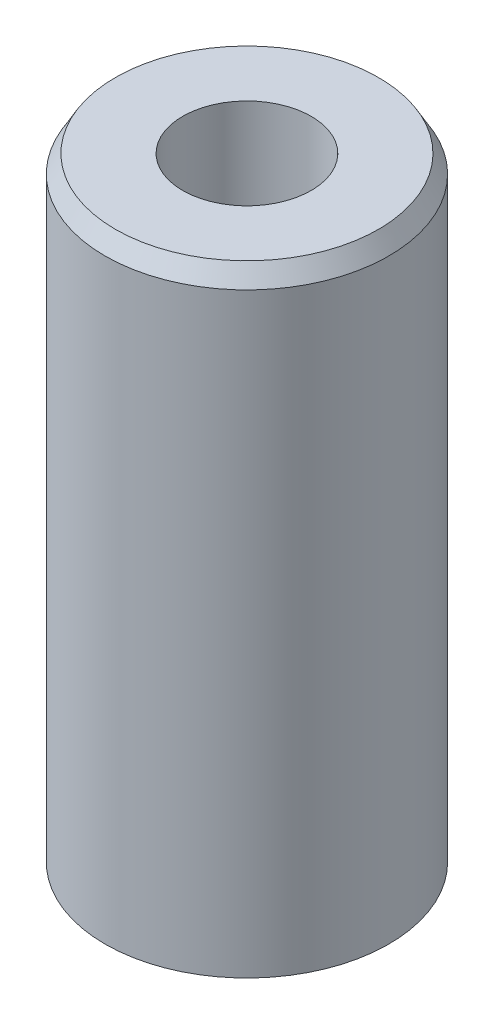
ISO-10303-21;
HEADER;
FILE_DESCRIPTION(('STEP AP214'),'2;1');
FILE_NAME('part.step','',(''),(''),'','','');
FILE_SCHEMA(('AUTOMOTIVE_DESIGN { 1 0 10303 214 1 1 1 1 }'));
ENDSEC;
DATA;
#1=APPLICATION_CONTEXT('core data for automotive mechanical design processes');
#2=APPLICATION_PROTOCOL_DEFINITION('international standard','automotive_design',2000,#1);
#3=PRODUCT_CONTEXT('',#1,'mechanical');
#4=PRODUCT('Part','Part','',(#3));
#5=PRODUCT_RELATED_PRODUCT_CATEGORY('part','',(#4));
#6=PRODUCT_DEFINITION_FORMATION('','',#4);
#7=PRODUCT_DEFINITION_CONTEXT('part definition',#1,'design');
#8=PRODUCT_DEFINITION('design','',#6,#7);
#9=PRODUCT_DEFINITION_SHAPE('','',#8);
#10=(LENGTH_UNIT() NAMED_UNIT(*) SI_UNIT(.MILLI.,.METRE.));
#11=(NAMED_UNIT(*) PLANE_ANGLE_UNIT() SI_UNIT($,.RADIAN.));
#12=(NAMED_UNIT(*) SI_UNIT($,.STERADIAN.) SOLID_ANGLE_UNIT());
#13=UNCERTAINTY_MEASURE_WITH_UNIT(LENGTH_MEASURE(1.E-05),#10,'distance_accuracy_value','');
#14=(GEOMETRIC_REPRESENTATION_CONTEXT(3) GLOBAL_UNCERTAINTY_ASSIGNED_CONTEXT((#13)) GLOBAL_UNIT_ASSIGNED_CONTEXT((#10,
#11,#12)) REPRESENTATION_CONTEXT('',''));
#15=CARTESIAN_POINT('',(0.,0.,0.));
#16=DIRECTION('',(0.,0.,1.));
#17=DIRECTION('',(1.,0.,0.));
#18=AXIS2_PLACEMENT_3D('',#15,#16,#17);
#19=CARTESIAN_POINT('',(0.,43.9895639407936,0.));
#20=DIRECTION('',(0.,-1.,0.));
#21=DIRECTION('',(0.,0.,-1.));
#22=AXIS2_PLACEMENT_3D('',#19,#20,#21);
#23=CYLINDRICAL_SURFACE('',#22,10.);
#24=CARTESIAN_POINT('',(0.,42.7277049202706,0.));
#25=DIRECTION('',(0.,1.,0.));
#26=DIRECTION('',(0.,0.,1.));
#27=AXIS2_PLACEMENT_3D('',#24,#25,#26);
#28=CIRCLE('',#27,10.);
#29=CARTESIAN_POINT('',(0.,42.7277049202706,10.));
#30=VERTEX_POINT('',#29);
#31=EDGE_CURVE('E50',#30,#30,#28,.F.);
#32=ORIENTED_EDGE('',*,*,#31,.T.);
#33=EDGE_LOOP('',(#32));
#34=FACE_BOUND('',#33,.T.);
#35=CARTESIAN_POINT('',(0.,0.728534645178309,0.));
#36=DIRECTION('',(0.,1.,0.));
#37=DIRECTION('',(0.,0.,1.));
#38=AXIS2_PLACEMENT_3D('',#35,#36,#37);
#39=CIRCLE('',#38,10.);
#40=CARTESIAN_POINT('',(0.,0.728534645178309,10.));
#41=VERTEX_POINT('',#40);
#42=EDGE_CURVE('E51',#41,#41,#39,.T.);
#43=ORIENTED_EDGE('',*,*,#42,.T.);
#44=EDGE_LOOP('',(#43));
#45=FACE_BOUND('',#44,.T.);
#46=ADVANCED_FACE('F39',(#34,#45),#23,.T.);
#47=CARTESIAN_POINT('',(0.,43.9895639407936,0.));
#48=DIRECTION('',(0.,1.,0.));
#49=DIRECTION('',(0.,0.,1.));
#50=AXIS2_PLACEMENT_3D('',#47,#48,#49);
#51=PLANE('',#50);
#52=CARTESIAN_POINT('',(0.,43.9895639407936,0.));
#53=DIRECTION('',(0.,1.,0.));
#54=DIRECTION('',(0.,0.,1.));
#55=AXIS2_PLACEMENT_3D('',#52,#53,#54);
#56=CIRCLE('',#55,9.27146535482168);
#57=CARTESIAN_POINT('',(0.,43.9895639407936,9.27146535482168));
#58=VERTEX_POINT('',#57);
#59=EDGE_CURVE('E54',#58,#58,#56,.T.);
#60=ORIENTED_EDGE('',*,*,#59,.T.);
#61=EDGE_LOOP('',(#60));
#62=FACE_BOUND('',#61,.T.);
#63=CARTESIAN_POINT('',(0.,43.9895639407936,0.));
#64=DIRECTION('',(0.,1.,0.));
#65=DIRECTION('',(0.,0.,1.));
#66=AXIS2_PLACEMENT_3D('',#63,#64,#65);
#67=CIRCLE('',#66,4.53011564633827);
#68=CARTESIAN_POINT('',(0.,43.9895639407936,4.53011564633827));
#69=VERTEX_POINT('',#68);
#70=EDGE_CURVE('E58',#69,#69,#67,.T.);
#71=ORIENTED_EDGE('',*,*,#70,.F.);
#72=EDGE_LOOP('',(#71));
#73=FACE_BOUND('',#72,.T.);
#74=ADVANCED_FACE('F69',(#62,#73),#51,.T.);
#75=CARTESIAN_POINT('',(0.,0.,0.));
#76=DIRECTION('',(0.,1.,0.));
#77=DIRECTION('',(0.,0.,1.));
#78=AXIS2_PLACEMENT_3D('',#75,#76,#77);
#79=PLANE('',#78);
#80=CARTESIAN_POINT('',(0.,0.,0.));
#81=DIRECTION('',(0.,1.,0.));
#82=DIRECTION('',(0.,0.,1.));
#83=AXIS2_PLACEMENT_3D('',#80,#81,#82);
#84=CIRCLE('',#83,8.73814097947699);
#85=CARTESIAN_POINT('',(0.,0.,8.73814097947699));
#86=VERTEX_POINT('',#85);
#87=EDGE_CURVE('E10',#86,#86,#84,.F.);
#88=ORIENTED_EDGE('',*,*,#87,.T.);
#89=EDGE_LOOP('',(#88));
#90=FACE_BOUND('',#89,.T.);
#91=CARTESIAN_POINT('',(0.,0.,0.));
#92=DIRECTION('',(0.,1.,0.));
#93=DIRECTION('',(0.,0.,1.));
#94=AXIS2_PLACEMENT_3D('',#91,#92,#93);
#95=CIRCLE('',#94,4.53011564633827);
#96=CARTESIAN_POINT('',(0.,0.,4.53011564633827));
#97=VERTEX_POINT('',#96);
#98=EDGE_CURVE('E63',#97,#97,#95,.T.);
#99=ORIENTED_EDGE('',*,*,#98,.T.);
#100=EDGE_LOOP('',(#99));
#101=FACE_BOUND('',#100,.T.);
#102=ADVANCED_FACE('F75',(#90,#101),#79,.F.);
#103=CARTESIAN_POINT('',(0.,43.9895639407936,0.));
#104=DIRECTION('',(0.,-1.,0.));
#105=DIRECTION('',(0.,0.,-1.));
#106=AXIS2_PLACEMENT_3D('',#103,#104,#105);
#107=CYLINDRICAL_SURFACE('',#106,4.53011564633827);
#108=ORIENTED_EDGE('',*,*,#70,.T.);
#109=EDGE_LOOP('',(#108));
#110=FACE_BOUND('',#109,.T.);
#111=ORIENTED_EDGE('',*,*,#98,.F.);
#112=EDGE_LOOP('',(#111));
#113=FACE_BOUND('',#112,.T.);
#114=ADVANCED_FACE('F70',(#110,#113),#107,.F.);
#115=CARTESIAN_POINT('',(0.,43.9895639407936,0.));
#116=DIRECTION('',(0.,-1.,0.));
#117=DIRECTION('',(0.,0.,-1.));
#118=AXIS2_PLACEMENT_3D('',#115,#116,#117);
#119=CONICAL_SURFACE('',#118,9.27146535482168,0.523598775598294);
#120=ORIENTED_EDGE('',*,*,#31,.F.);
#121=EDGE_LOOP('',(#120));
#122=FACE_BOUND('',#121,.T.);
#123=ORIENTED_EDGE('',*,*,#59,.F.);
#124=EDGE_LOOP('',(#123));
#125=FACE_BOUND('',#124,.T.);
#126=ADVANCED_FACE('F81',(#122,#125),#119,.T.);
#127=CARTESIAN_POINT('',(0.,0.728534645178309,0.));
#128=DIRECTION('',(0.,1.,0.));
#129=DIRECTION('',(0.,0.,1.));
#130=AXIS2_PLACEMENT_3D('',#127,#128,#129);
#131=CONICAL_SURFACE('',#130,10.,1.0471975511966);
#132=ORIENTED_EDGE('',*,*,#87,.F.);
#133=EDGE_LOOP('',(#132));
#134=FACE_BOUND('',#133,.T.);
#135=ORIENTED_EDGE('',*,*,#42,.F.);
#136=EDGE_LOOP('',(#135));
#137=FACE_BOUND('',#136,.T.);
#138=ADVANCED_FACE('F45',(#134,#137),#131,.T.);
#139=CLOSED_SHELL('',(#46,#74,#102,#114,#126,#138));
#140=MANIFOLD_SOLID_BREP('B2',#139);
#141=ADVANCED_BREP_SHAPE_REPRESENTATION('',(#18,#140),#14);
#142=SHAPE_DEFINITION_REPRESENTATION(#9,#141);
ENDSEC;
END-ISO-10303-21;
